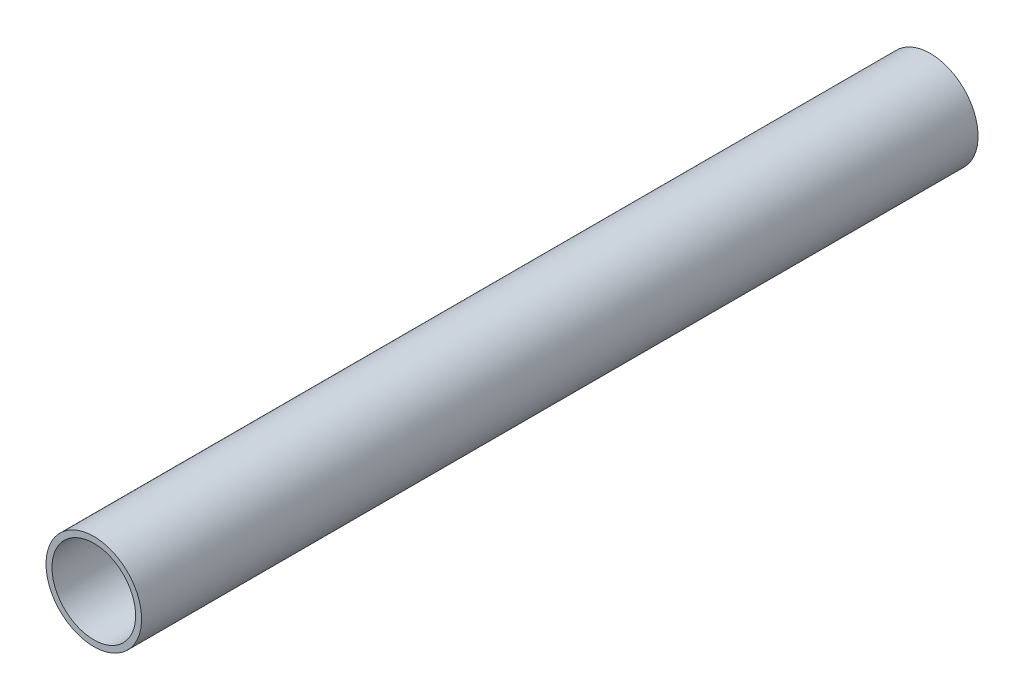
ISO-10303-21;
HEADER;
FILE_DESCRIPTION(('STEP AP214'),'2;1');
FILE_NAME('part.step','',(''),(''),'','','');
FILE_SCHEMA(('AUTOMOTIVE_DESIGN { 1 0 10303 214 1 1 1 1 }'));
ENDSEC;
DATA;
#1=APPLICATION_CONTEXT('core data for automotive mechanical design processes');
#2=APPLICATION_PROTOCOL_DEFINITION('international standard','automotive_design',2000,#1);
#3=PRODUCT_CONTEXT('',#1,'mechanical');
#4=PRODUCT('Part','Part','',(#3));
#5=PRODUCT_RELATED_PRODUCT_CATEGORY('part','',(#4));
#6=PRODUCT_DEFINITION_FORMATION('','',#4);
#7=PRODUCT_DEFINITION_CONTEXT('part definition',#1,'design');
#8=PRODUCT_DEFINITION('design','',#6,#7);
#9=PRODUCT_DEFINITION_SHAPE('','',#8);
#10=(LENGTH_UNIT() NAMED_UNIT(*) SI_UNIT(.MILLI.,.METRE.));
#11=(NAMED_UNIT(*) PLANE_ANGLE_UNIT() SI_UNIT($,.RADIAN.));
#12=(NAMED_UNIT(*) SI_UNIT($,.STERADIAN.) SOLID_ANGLE_UNIT());
#13=UNCERTAINTY_MEASURE_WITH_UNIT(LENGTH_MEASURE(1.E-05),#10,'distance_accuracy_value','');
#14=(GEOMETRIC_REPRESENTATION_CONTEXT(3) GLOBAL_UNCERTAINTY_ASSIGNED_CONTEXT((#13)) GLOBAL_UNIT_ASSIGNED_CONTEXT((#10,
#11,#12)) REPRESENTATION_CONTEXT('',''));
#15=CARTESIAN_POINT('',(0.,0.,0.));
#16=DIRECTION('',(0.,0.,1.));
#17=DIRECTION('',(1.,0.,0.));
#18=AXIS2_PLACEMENT_3D('',#15,#16,#17);
#19=CARTESIAN_POINT('',(0.,-100.,0.));
#20=DIRECTION('',(0.,0.,1.));
#21=DIRECTION('',(1.,0.,0.));
#22=AXIS2_PLACEMENT_3D('',#19,#20,#21);
#23=PLANE('',#22);
#24=CARTESIAN_POINT('',(0.,-100.,0.));
#25=DIRECTION('',(0.,0.,-1.));
#26=DIRECTION('',(1.,0.,0.));
#27=AXIS2_PLACEMENT_3D('',#24,#25,#26);
#28=CIRCLE('',#27,7.);
#29=CARTESIAN_POINT('',(-7.,-100.,0.));
#30=VERTEX_POINT('',#29);
#31=EDGE_CURVE('E52',#30,#30,#28,.T.);
#32=ORIENTED_EDGE('',*,*,#31,.F.);
#33=EDGE_LOOP('',(#32));
#34=FACE_BOUND('',#33,.T.);
#35=CARTESIAN_POINT('',(0.,-100.,0.));
#36=DIRECTION('',(0.,0.,1.));
#37=DIRECTION('',(1.,0.,0.));
#38=AXIS2_PLACEMENT_3D('',#35,#36,#37);
#39=CIRCLE('',#38,8.);
#40=CARTESIAN_POINT('',(-8.,-100.,0.));
#41=VERTEX_POINT('',#40);
#42=EDGE_CURVE('E10',#41,#41,#39,.T.);
#43=ORIENTED_EDGE('',*,*,#42,.F.);
#44=EDGE_LOOP('',(#43));
#45=FACE_BOUND('',#44,.T.);
#46=ADVANCED_FACE('F15',(#34,#45),#23,.F.);
#47=CARTESIAN_POINT('',(0.,-100.,140.));
#48=DIRECTION('',(0.,0.,1.));
#49=DIRECTION('',(1.,0.,0.));
#50=AXIS2_PLACEMENT_3D('',#47,#48,#49);
#51=PLANE('',#50);
#52=CARTESIAN_POINT('',(0.,-100.,140.));
#53=DIRECTION('',(0.,0.,-1.));
#54=DIRECTION('',(1.,0.,0.));
#55=AXIS2_PLACEMENT_3D('',#52,#53,#54);
#56=CIRCLE('',#55,7.);
#57=CARTESIAN_POINT('',(-7.,-100.,140.));
#58=VERTEX_POINT('',#57);
#59=EDGE_CURVE('E18',#58,#58,#56,.T.);
#60=ORIENTED_EDGE('',*,*,#59,.T.);
#61=EDGE_LOOP('',(#60));
#62=FACE_BOUND('',#61,.T.);
#63=CARTESIAN_POINT('',(0.,-100.,140.));
#64=DIRECTION('',(0.,0.,1.));
#65=DIRECTION('',(1.,0.,0.));
#66=AXIS2_PLACEMENT_3D('',#63,#64,#65);
#67=CIRCLE('',#66,8.);
#68=CARTESIAN_POINT('',(-8.,-100.,140.));
#69=VERTEX_POINT('',#68);
#70=EDGE_CURVE('E56',#69,#69,#67,.T.);
#71=ORIENTED_EDGE('',*,*,#70,.T.);
#72=EDGE_LOOP('',(#71));
#73=FACE_BOUND('',#72,.T.);
#74=ADVANCED_FACE('F72',(#62,#73),#51,.T.);
#75=CARTESIAN_POINT('',(0.,-100.,0.));
#76=DIRECTION('',(0.,0.,1.));
#77=DIRECTION('',(1.,0.,0.));
#78=AXIS2_PLACEMENT_3D('',#75,#76,#77);
#79=CYLINDRICAL_SURFACE('',#78,8.);
#80=ORIENTED_EDGE('',*,*,#70,.F.);
#81=DIRECTION('',(0.,0.,-1.));
#82=VECTOR('',#81,1.);
#83=CARTESIAN_POINT('',(-8.,-100.,0.));
#84=LINE('',#83,#82);
#85=EDGE_CURVE('E25',#69,#41,#84,.T.);
#86=ORIENTED_EDGE('',*,*,#85,.T.);
#87=ORIENTED_EDGE('',*,*,#42,.T.);
#88=ORIENTED_EDGE('',*,*,#85,.F.);
#89=EDGE_LOOP('',(#80,#86,#87,#88));
#90=FACE_BOUND('',#89,.T.);
#91=ADVANCED_FACE('F70',(#90),#79,.T.);
#92=CARTESIAN_POINT('',(0.,-100.,0.));
#93=DIRECTION('',(0.,0.,1.));
#94=DIRECTION('',(1.,0.,0.));
#95=AXIS2_PLACEMENT_3D('',#92,#93,#94);
#96=CYLINDRICAL_SURFACE('',#95,7.);
#97=ORIENTED_EDGE('',*,*,#59,.F.);
#98=DIRECTION('',(0.,0.,-1.));
#99=VECTOR('',#98,1.);
#100=CARTESIAN_POINT('',(-7.,-100.,0.));
#101=LINE('',#100,#99);
#102=EDGE_CURVE('E47',#58,#30,#101,.T.);
#103=ORIENTED_EDGE('',*,*,#102,.T.);
#104=ORIENTED_EDGE('',*,*,#31,.T.);
#105=ORIENTED_EDGE('',*,*,#102,.F.);
#106=EDGE_LOOP('',(#97,#103,#104,#105));
#107=FACE_BOUND('',#106,.T.);
#108=ADVANCED_FACE('F53',(#107),#96,.F.);
#109=CLOSED_SHELL('',(#46,#74,#91,#108));
#110=MANIFOLD_SOLID_BREP('B1',#109);
#111=ADVANCED_BREP_SHAPE_REPRESENTATION('',(#18,#110),#14);
#112=SHAPE_DEFINITION_REPRESENTATION(#9,#111);
ENDSEC;
END-ISO-10303-21;
